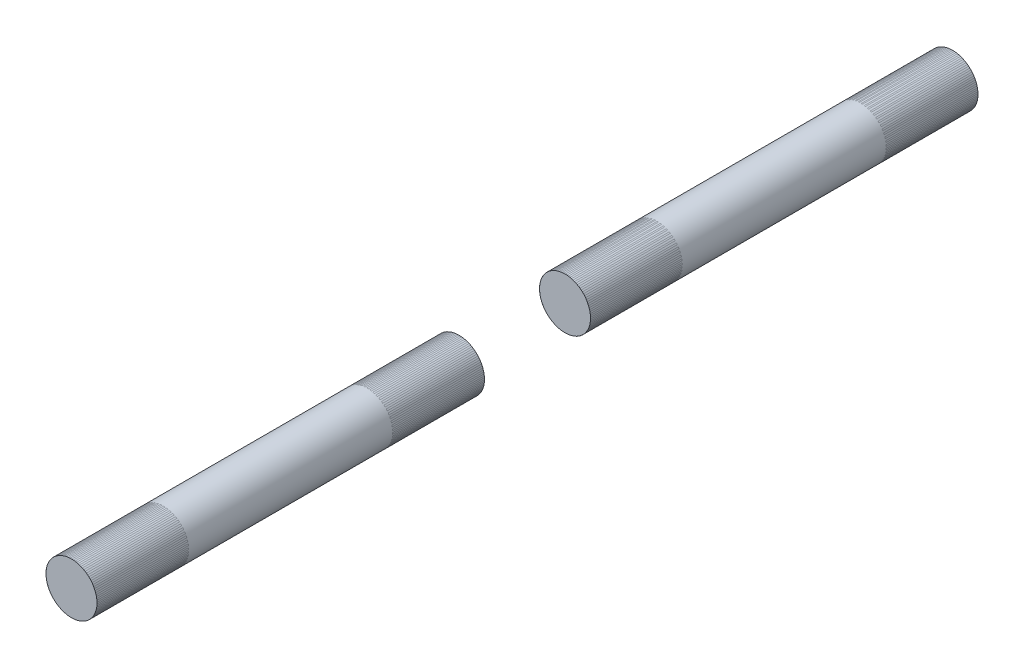
ISO-10303-21;
HEADER;
FILE_DESCRIPTION(('STEP AP214'),'2;1');
FILE_NAME('part.step','',(''),(''),'','','');
FILE_SCHEMA(('AUTOMOTIVE_DESIGN { 1 0 10303 214 1 1 1 1 }'));
ENDSEC;
DATA;
#1=APPLICATION_CONTEXT('core data for automotive mechanical design processes');
#2=APPLICATION_PROTOCOL_DEFINITION('international standard','automotive_design',2000,#1);
#3=PRODUCT_CONTEXT('',#1,'mechanical');
#4=PRODUCT('Part','Part','',(#3));
#5=PRODUCT_RELATED_PRODUCT_CATEGORY('part','',(#4));
#6=PRODUCT_DEFINITION_FORMATION('','',#4);
#7=PRODUCT_DEFINITION_CONTEXT('part definition',#1,'design');
#8=PRODUCT_DEFINITION('design','',#6,#7);
#9=PRODUCT_DEFINITION_SHAPE('','',#8);
#10=(LENGTH_UNIT() NAMED_UNIT(*) SI_UNIT(.MILLI.,.METRE.));
#11=(NAMED_UNIT(*) PLANE_ANGLE_UNIT() SI_UNIT($,.RADIAN.));
#12=(NAMED_UNIT(*) SI_UNIT($,.STERADIAN.) SOLID_ANGLE_UNIT());
#13=UNCERTAINTY_MEASURE_WITH_UNIT(LENGTH_MEASURE(1.E-05),#10,'distance_accuracy_value','');
#14=(GEOMETRIC_REPRESENTATION_CONTEXT(3) GLOBAL_UNCERTAINTY_ASSIGNED_CONTEXT((#13)) GLOBAL_UNIT_ASSIGNED_CONTEXT((#10,
#11,#12)) REPRESENTATION_CONTEXT('',''));
#15=CARTESIAN_POINT('',(0.,0.,0.));
#16=DIRECTION('',(0.,0.,1.));
#17=DIRECTION('',(1.,0.,0.));
#18=AXIS2_PLACEMENT_3D('',#15,#16,#17);
#19=CARTESIAN_POINT('',(0.,0.,-22.86));
#20=DIRECTION('',(0.,0.,-1.));
#21=DIRECTION('',(-1.,0.,0.));
#22=AXIS2_PLACEMENT_3D('',#19,#20,#21);
#23=PLANE('',#22);
#24=CARTESIAN_POINT('',(-1.16303436903898E-13,0.,-22.86));
#25=DIRECTION('',(0.,0.,-1.));
#26=DIRECTION('',(-1.,0.,0.));
#27=AXIS2_PLACEMENT_3D('',#24,#25,#26);
#28=CIRCLE('',#27,6.35);
#29=CARTESIAN_POINT('',(-6.35000000000012,0.,-22.86));
#30=VERTEX_POINT('',#29);
#31=EDGE_CURVE('E11',#30,#30,#28,.F.);
#32=ORIENTED_EDGE('',*,*,#31,.F.);
#33=EDGE_LOOP('',(#32));
#34=FACE_BOUND('',#33,.T.);
#35=ADVANCED_FACE('F41',(#34),#23,.T.);
#36=CARTESIAN_POINT('',(-1.16303436903898E-13,0.,73.66));
#37=DIRECTION('',(0.,0.,1.));
#38=DIRECTION('',(1.,0.,0.));
#39=AXIS2_PLACEMENT_3D('',#36,#37,#38);
#40=PLANE('',#39);
#41=CARTESIAN_POINT('',(-1.16303436903898E-13,0.,73.66));
#42=DIRECTION('',(0.,0.,1.));
#43=DIRECTION('',(1.,0.,0.));
#44=AXIS2_PLACEMENT_3D('',#41,#42,#43);
#45=CIRCLE('',#44,6.35);
#46=CARTESIAN_POINT('',(6.34999999999988,0.,73.66));
#47=VERTEX_POINT('',#46);
#48=EDGE_CURVE('E47',#47,#47,#45,.T.);
#49=ORIENTED_EDGE('',*,*,#48,.T.);
#50=EDGE_LOOP('',(#49));
#51=FACE_BOUND('',#50,.T.);
#52=ADVANCED_FACE('F53',(#51),#40,.T.);
#53=CARTESIAN_POINT('',(-1.16303436903898E-13,0.,-40.8205122421383));
#54=DIRECTION('',(0.,0.,1.));
#55=DIRECTION('',(1.,0.,0.));
#56=AXIS2_PLACEMENT_3D('',#53,#54,#55);
#57=CYLINDRICAL_SURFACE('',#56,6.35);
#58=ORIENTED_EDGE('',*,*,#48,.F.);
#59=EDGE_LOOP('',(#58));
#60=FACE_BOUND('',#59,.T.);
#61=ORIENTED_EDGE('',*,*,#31,.T.);
#62=EDGE_LOOP('',(#61));
#63=FACE_BOUND('',#62,.T.);
#64=ADVANCED_FACE('F55',(#60,#63),#57,.T.);
#65=CLOSED_SHELL('',(#35,#52,#64));
#66=MANIFOLD_SOLID_BREP('B2',#65);
#67=CARTESIAN_POINT('',(0.,0.,82.1154877578616));
#68=DIRECTION('',(0.,0.,1.));
#69=DIRECTION('',(1.,0.,0.));
#70=AXIS2_PLACEMENT_3D('',#67,#68,#69);
#71=CYLINDRICAL_SURFACE('',#70,6.35);
#72=CARTESIAN_POINT('',(0.,0.,100.076));
#73=DIRECTION('',(0.,0.,1.));
#74=DIRECTION('',(1.,0.,0.));
#75=AXIS2_PLACEMENT_3D('',#72,#73,#74);
#76=CIRCLE('',#75,6.35);
#77=CARTESIAN_POINT('',(6.35,0.,100.076));
#78=VERTEX_POINT('',#77);
#79=EDGE_CURVE('E40',#78,#78,#76,.F.);
#80=ORIENTED_EDGE('',*,*,#79,.F.);
#81=EDGE_LOOP('',(#80));
#82=FACE_BOUND('',#81,.T.);
#83=CARTESIAN_POINT('',(0.,0.,196.596));
#84=DIRECTION('',(0.,0.,1.));
#85=DIRECTION('',(1.,0.,0.));
#86=AXIS2_PLACEMENT_3D('',#83,#84,#85);
#87=CIRCLE('',#86,6.35);
#88=CARTESIAN_POINT('',(6.35,0.,196.596));
#89=VERTEX_POINT('',#88);
#90=EDGE_CURVE('E95',#89,#89,#87,.T.);
#91=ORIENTED_EDGE('',*,*,#90,.F.);
#92=EDGE_LOOP('',(#91));
#93=FACE_BOUND('',#92,.T.);
#94=ADVANCED_FACE('F89',(#82,#93),#71,.T.);
#95=CARTESIAN_POINT('',(0.,0.,196.596));
#96=DIRECTION('',(0.,0.,1.));
#97=DIRECTION('',(1.,0.,0.));
#98=AXIS2_PLACEMENT_3D('',#95,#96,#97);
#99=PLANE('',#98);
#100=ORIENTED_EDGE('',*,*,#90,.T.);
#101=EDGE_LOOP('',(#100));
#102=FACE_BOUND('',#101,.T.);
#103=ADVANCED_FACE('F101',(#102),#99,.T.);
#104=CARTESIAN_POINT('',(0.,0.,100.076));
#105=DIRECTION('',(0.,0.,1.));
#106=DIRECTION('',(1.,0.,0.));
#107=AXIS2_PLACEMENT_3D('',#104,#105,#106);
#108=PLANE('',#107);
#109=ORIENTED_EDGE('',*,*,#79,.T.);
#110=EDGE_LOOP('',(#109));
#111=FACE_BOUND('',#110,.T.);
#112=ADVANCED_FACE('F108',(#111),#108,.F.);
#113=CLOSED_SHELL('',(#94,#103,#112));
#114=MANIFOLD_SOLID_BREP('B6',#113);
#115=CARTESIAN_POINT('',(-1.90819582357449E-13,0.,185.166));
#116=DIRECTION('',(0.,0.,1.));
#117=DIRECTION('',(0.482671383681736,-0.875801538805886,0.));
#118=AXIS2_PLACEMENT_3D('',#115,#116,#117);
#119=CYLINDRICAL_SURFACE('',#118,6.35);
#120=CARTESIAN_POINT('',(-1.90819582357449E-13,0.,173.736));
#121=DIRECTION('',(0.,0.,1.));
#122=DIRECTION('',(0.482671383681736,-0.875801538805886,0.));
#123=AXIS2_PLACEMENT_3D('',#120,#121,#122);
#124=CIRCLE('',#123,6.35);
#125=CARTESIAN_POINT('',(3.06496328637883,-5.56133977141747,173.736));
#126=VERTEX_POINT('',#125);
#127=EDGE_CURVE('E141',#126,#126,#124,.T.);
#128=ORIENTED_EDGE('',*,*,#127,.F.);
#129=EDGE_LOOP('',(#128));
#130=FACE_BOUND('',#129,.T.);
#131=CARTESIAN_POINT('',(-1.94289029309402E-13,0.,196.596));
#132=DIRECTION('',(0.,0.,1.));
#133=DIRECTION('',(0.482671383681736,-0.875801538805886,0.));
#134=AXIS2_PLACEMENT_3D('',#131,#132,#133);
#135=CIRCLE('',#134,6.35);
#136=CARTESIAN_POINT('',(3.06496328637883,-5.56133977141748,196.596));
#137=VERTEX_POINT('',#136);
#138=EDGE_CURVE('E88',#137,#137,#135,.F.);
#139=ORIENTED_EDGE('',*,*,#138,.F.);
#140=EDGE_LOOP('',(#139));
#141=FACE_BOUND('',#140,.T.);
#142=ADVANCED_FACE('F137',(#130,#141),#119,.F.);
#143=OPEN_SHELL('',(#142));
#144=SHELL_BASED_SURFACE_MODEL('B35',(#143));
#145=CARTESIAN_POINT('',(-1.17528442315558E-13,0.,62.2299999999999));
#146=DIRECTION('',(0.,0.,1.));
#147=DIRECTION('',(0.482671383681736,-0.875801538805886,0.));
#148=AXIS2_PLACEMENT_3D('',#145,#146,#147);
#149=CYLINDRICAL_SURFACE('',#148,6.35);
#150=CARTESIAN_POINT('',(-1.18753447727219E-13,0.,50.7999999999999));
#151=DIRECTION('',(0.,0.,1.));
#152=DIRECTION('',(0.482671383681736,-0.875801538805886,0.));
#153=AXIS2_PLACEMENT_3D('',#150,#151,#152);
#154=CIRCLE('',#153,6.35);
#155=CARTESIAN_POINT('',(3.0649632863789,-5.56133977141738,50.7999999999999));
#156=VERTEX_POINT('',#155);
#157=EDGE_CURVE('E136',#156,#156,#154,.T.);
#158=ORIENTED_EDGE('',*,*,#157,.F.);
#159=EDGE_LOOP('',(#158));
#160=FACE_BOUND('',#159,.T.);
#161=CARTESIAN_POINT('',(-1.16303436903898E-13,0.,73.66));
#162=DIRECTION('',(0.,0.,1.));
#163=DIRECTION('',(0.482671383681736,-0.875801538805886,0.));
#164=AXIS2_PLACEMENT_3D('',#161,#162,#163);
#165=CIRCLE('',#164,6.35);
#166=CARTESIAN_POINT('',(3.06496328637891,-5.56133977141739,73.66));
#167=VERTEX_POINT('',#166);
#168=EDGE_CURVE('E173',#167,#167,#165,.F.);
#169=ORIENTED_EDGE('',*,*,#168,.F.);
#170=EDGE_LOOP('',(#169));
#171=FACE_BOUND('',#170,.T.);
#172=ADVANCED_FACE('F169',(#160,#171),#149,.F.);
#173=OPEN_SHELL('',(#172));
#174=SHELL_BASED_SURFACE_MODEL('B83',(#173));
#175=CARTESIAN_POINT('',(-1.11909504257851E-13,0.,111.506));
#176=DIRECTION('',(0.,0.,-1.));
#177=DIRECTION('',(-0.482671383681736,0.875801538805886,0.));
#178=AXIS2_PLACEMENT_3D('',#175,#176,#177);
#179=CYLINDRICAL_SURFACE('',#178,6.35);
#180=CARTESIAN_POINT('',(-1.11022302462516E-13,0.,122.936));
#181=DIRECTION('',(0.,0.,-1.));
#182=DIRECTION('',(-0.482671383681736,0.875801538805886,0.));
#183=AXIS2_PLACEMENT_3D('',#180,#181,#182);
#184=CIRCLE('',#183,6.35);
#185=CARTESIAN_POINT('',(-3.06496328637913,5.56133977141735,122.936));
#186=VERTEX_POINT('',#185);
#187=EDGE_CURVE('E204',#186,#186,#184,.T.);
#188=ORIENTED_EDGE('',*,*,#187,.F.);
#189=EDGE_LOOP('',(#188));
#190=FACE_BOUND('',#189,.T.);
#191=CARTESIAN_POINT('',(-1.12796706053185E-13,0.,100.076));
#192=DIRECTION('',(0.,0.,-1.));
#193=DIRECTION('',(-0.482671383681736,0.875801538805886,0.));
#194=AXIS2_PLACEMENT_3D('',#191,#192,#193);
#195=CIRCLE('',#194,6.35);
#196=CARTESIAN_POINT('',(-3.06496328637914,5.56133977141736,100.076));
#197=VERTEX_POINT('',#196);
#198=EDGE_CURVE('E168',#197,#197,#195,.F.);
#199=ORIENTED_EDGE('',*,*,#198,.F.);
#200=EDGE_LOOP('',(#199));
#201=FACE_BOUND('',#200,.T.);
#202=ADVANCED_FACE('F200',(#190,#201),#179,.F.);
#203=OPEN_SHELL('',(#202));
#204=SHELL_BASED_SURFACE_MODEL('B131',(#203));
#205=CARTESIAN_POINT('',(-1.16831433416564E-13,0.,-11.43));
#206=DIRECTION('',(0.,0.,-1.));
#207=DIRECTION('',(-1.,0.,0.));
#208=AXIS2_PLACEMENT_3D('',#205,#206,#207);
#209=CYLINDRICAL_SURFACE('',#208,6.35);
#210=CARTESIAN_POINT('',(-1.11755493747978E-13,0.,-22.86));
#211=DIRECTION('',(0.,0.,-1.));
#212=DIRECTION('',(-1.,0.,0.));
#213=AXIS2_PLACEMENT_3D('',#210,#211,#212);
#214=CIRCLE('',#213,6.35);
#215=CARTESIAN_POINT('',(-6.35000000000011,0.,-22.86));
#216=VERTEX_POINT('',#215);
#217=EDGE_CURVE('E228',#216,#216,#214,.F.);
#218=ORIENTED_EDGE('',*,*,#217,.F.);
#219=EDGE_LOOP('',(#218));
#220=FACE_BOUND('',#219,.T.);
#221=CARTESIAN_POINT('',(-1.21907373085151E-13,0.,0.));
#222=DIRECTION('',(0.,0.,-1.));
#223=DIRECTION('',(-1.,0.,0.));
#224=AXIS2_PLACEMENT_3D('',#221,#222,#223);
#225=CIRCLE('',#224,6.35);
#226=CARTESIAN_POINT('',(-6.35000000000012,0.,0.));
#227=VERTEX_POINT('',#226);
#228=EDGE_CURVE('E199',#227,#227,#225,.T.);
#229=ORIENTED_EDGE('',*,*,#228,.F.);
#230=EDGE_LOOP('',(#229));
#231=FACE_BOUND('',#230,.T.);
#232=ADVANCED_FACE('F224',(#220,#231),#209,.F.);
#233=OPEN_SHELL('',(#232));
#234=SHELL_BASED_SURFACE_MODEL('B163',(#233));
#235=ADVANCED_BREP_SHAPE_REPRESENTATION('',(#18,#66,#114),#14);
#236=MANIFOLD_SURFACE_SHAPE_REPRESENTATION('',(#18,#144,#174,#204,#234),#14);
#237=SHAPE_REPRESENTATION('',(#18),#14);
#238=SHAPE_DEFINITION_REPRESENTATION(#9,#237);
#239=SHAPE_REPRESENTATION_RELATIONSHIP('','',#237,#235);
#240=SHAPE_REPRESENTATION_RELATIONSHIP('','',#237,#236);
ENDSEC;
END-ISO-10303-21;
